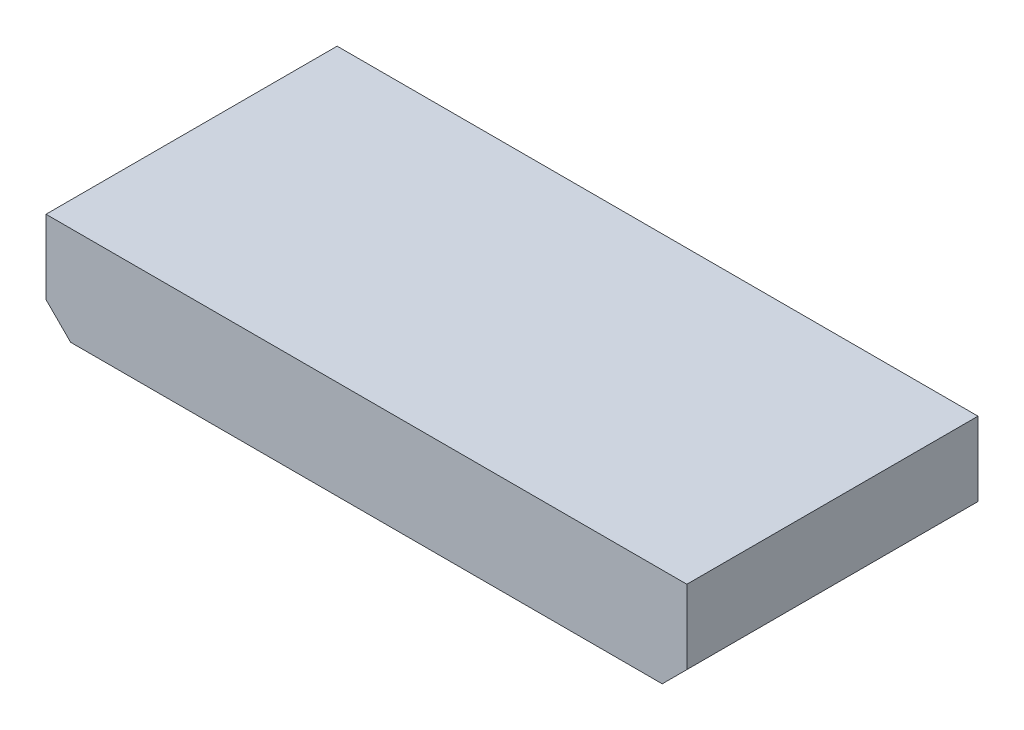
ISO-10303-21;
HEADER;
FILE_DESCRIPTION(('STEP AP214'),'2;1');
FILE_NAME('part.step','',(''),(''),'','','');
FILE_SCHEMA(('AUTOMOTIVE_DESIGN { 1 0 10303 214 1 1 1 1 }'));
ENDSEC;
DATA;
#1=APPLICATION_CONTEXT('core data for automotive mechanical design processes');
#2=APPLICATION_PROTOCOL_DEFINITION('international standard','automotive_design',2000,#1);
#3=PRODUCT_CONTEXT('',#1,'mechanical');
#4=PRODUCT('Part','Part','',(#3));
#5=PRODUCT_RELATED_PRODUCT_CATEGORY('part','',(#4));
#6=PRODUCT_DEFINITION_FORMATION('','',#4);
#7=PRODUCT_DEFINITION_CONTEXT('part definition',#1,'design');
#8=PRODUCT_DEFINITION('design','',#6,#7);
#9=PRODUCT_DEFINITION_SHAPE('','',#8);
#10=(LENGTH_UNIT() NAMED_UNIT(*) SI_UNIT(.MILLI.,.METRE.));
#11=(NAMED_UNIT(*) PLANE_ANGLE_UNIT() SI_UNIT($,.RADIAN.));
#12=(NAMED_UNIT(*) SI_UNIT($,.STERADIAN.) SOLID_ANGLE_UNIT());
#13=UNCERTAINTY_MEASURE_WITH_UNIT(LENGTH_MEASURE(1.E-05),#10,'distance_accuracy_value','');
#14=(GEOMETRIC_REPRESENTATION_CONTEXT(3) GLOBAL_UNCERTAINTY_ASSIGNED_CONTEXT((#13)) GLOBAL_UNIT_ASSIGNED_CONTEXT((#10,
#11,#12)) REPRESENTATION_CONTEXT('',''));
#15=CARTESIAN_POINT('',(0.,0.,0.));
#16=DIRECTION('',(0.,0.,1.));
#17=DIRECTION('',(1.,0.,0.));
#18=AXIS2_PLACEMENT_3D('',#15,#16,#17);
#19=CARTESIAN_POINT('',(22.86,0.,-2.));
#20=DIRECTION('',(0.,0.,1.));
#21=DIRECTION('',(1.,0.,0.));
#22=AXIS2_PLACEMENT_3D('',#19,#20,#21);
#23=CYLINDRICAL_SURFACE('',#22,0.25);
#24=CARTESIAN_POINT('',(22.86,0.,-2.));
#25=DIRECTION('',(0.,0.,1.));
#26=DIRECTION('',(1.,0.,0.));
#27=AXIS2_PLACEMENT_3D('',#24,#25,#26);
#28=CIRCLE('',#27,0.25);
#29=CARTESIAN_POINT('',(23.11,0.,-2.));
#30=VERTEX_POINT('',#29);
#31=EDGE_CURVE('E11',#30,#30,#28,.T.);
#32=ORIENTED_EDGE('',*,*,#31,.T.);
#33=EDGE_LOOP('',(#32));
#34=FACE_BOUND('',#33,.T.);
#35=CARTESIAN_POINT('',(22.86,0.,0.));
#36=DIRECTION('',(0.,0.,1.));
#37=DIRECTION('',(1.,0.,0.));
#38=AXIS2_PLACEMENT_3D('',#35,#36,#37);
#39=CIRCLE('',#38,0.25);
#40=CARTESIAN_POINT('',(23.11,0.,0.));
#41=VERTEX_POINT('',#40);
#42=EDGE_CURVE('E43',#41,#41,#39,.T.);
#43=ORIENTED_EDGE('',*,*,#42,.F.);
#44=EDGE_LOOP('',(#43));
#45=FACE_BOUND('',#44,.T.);
#46=ADVANCED_FACE('F40',(#34,#45),#23,.T.);
#47=CARTESIAN_POINT('',(22.86,0.,-2.));
#48=DIRECTION('',(0.,0.,1.));
#49=DIRECTION('',(1.,0.,0.));
#50=AXIS2_PLACEMENT_3D('',#47,#48,#49);
#51=PLANE('',#50);
#52=ORIENTED_EDGE('',*,*,#31,.F.);
#53=EDGE_LOOP('',(#52));
#54=FACE_BOUND('',#53,.T.);
#55=ADVANCED_FACE('F55',(#54),#51,.F.);
#56=CARTESIAN_POINT('',(22.86,0.,0.));
#57=DIRECTION('',(0.,0.,1.));
#58=DIRECTION('',(1.,0.,0.));
#59=AXIS2_PLACEMENT_3D('',#56,#57,#58);
#60=PLANE('',#59);
#61=ORIENTED_EDGE('',*,*,#42,.T.);
#62=EDGE_LOOP('',(#61));
#63=FACE_BOUND('',#62,.T.);
#64=ADVANCED_FACE('F52',(#63),#60,.T.);
#65=CLOSED_SHELL('',(#46,#55,#64));
#66=MANIFOLD_SOLID_BREP('B2',#65);
#67=CARTESIAN_POINT('',(20.32,0.,-2.));
#68=DIRECTION('',(0.,0.,1.));
#69=DIRECTION('',(1.,0.,0.));
#70=AXIS2_PLACEMENT_3D('',#67,#68,#69);
#71=CYLINDRICAL_SURFACE('',#70,0.25);
#72=CARTESIAN_POINT('',(20.32,0.,-2.));
#73=DIRECTION('',(0.,0.,1.));
#74=DIRECTION('',(1.,0.,0.));
#75=AXIS2_PLACEMENT_3D('',#72,#73,#74);
#76=CIRCLE('',#75,0.25);
#77=CARTESIAN_POINT('',(20.57,0.,-2.));
#78=VERTEX_POINT('',#77);
#79=EDGE_CURVE('E39',#78,#78,#76,.T.);
#80=ORIENTED_EDGE('',*,*,#79,.T.);
#81=EDGE_LOOP('',(#80));
#82=FACE_BOUND('',#81,.T.);
#83=CARTESIAN_POINT('',(20.32,0.,0.));
#84=DIRECTION('',(0.,0.,1.));
#85=DIRECTION('',(1.,0.,0.));
#86=AXIS2_PLACEMENT_3D('',#83,#84,#85);
#87=CIRCLE('',#86,0.25);
#88=CARTESIAN_POINT('',(20.57,0.,0.));
#89=VERTEX_POINT('',#88);
#90=EDGE_CURVE('E92',#89,#89,#87,.T.);
#91=ORIENTED_EDGE('',*,*,#90,.F.);
#92=EDGE_LOOP('',(#91));
#93=FACE_BOUND('',#92,.T.);
#94=ADVANCED_FACE('F89',(#82,#93),#71,.T.);
#95=CARTESIAN_POINT('',(20.32,0.,-2.));
#96=DIRECTION('',(0.,0.,1.));
#97=DIRECTION('',(1.,0.,0.));
#98=AXIS2_PLACEMENT_3D('',#95,#96,#97);
#99=PLANE('',#98);
#100=ORIENTED_EDGE('',*,*,#79,.F.);
#101=EDGE_LOOP('',(#100));
#102=FACE_BOUND('',#101,.T.);
#103=ADVANCED_FACE('F104',(#102),#99,.F.);
#104=CARTESIAN_POINT('',(20.32,0.,0.));
#105=DIRECTION('',(0.,0.,1.));
#106=DIRECTION('',(1.,0.,0.));
#107=AXIS2_PLACEMENT_3D('',#104,#105,#106);
#108=PLANE('',#107);
#109=ORIENTED_EDGE('',*,*,#90,.T.);
#110=EDGE_LOOP('',(#109));
#111=FACE_BOUND('',#110,.T.);
#112=ADVANCED_FACE('F101',(#111),#108,.T.);
#113=CLOSED_SHELL('',(#94,#103,#112));
#114=MANIFOLD_SOLID_BREP('B6',#113);
#115=CARTESIAN_POINT('',(17.78,0.,-2.));
#116=DIRECTION('',(0.,0.,1.));
#117=DIRECTION('',(1.,0.,0.));
#118=AXIS2_PLACEMENT_3D('',#115,#116,#117);
#119=CYLINDRICAL_SURFACE('',#118,0.25);
#120=CARTESIAN_POINT('',(17.78,0.,-2.));
#121=DIRECTION('',(0.,0.,1.));
#122=DIRECTION('',(1.,0.,0.));
#123=AXIS2_PLACEMENT_3D('',#120,#121,#122);
#124=CIRCLE('',#123,0.25);
#125=CARTESIAN_POINT('',(18.03,0.,-2.));
#126=VERTEX_POINT('',#125);
#127=EDGE_CURVE('E88',#126,#126,#124,.T.);
#128=ORIENTED_EDGE('',*,*,#127,.T.);
#129=EDGE_LOOP('',(#128));
#130=FACE_BOUND('',#129,.T.);
#131=CARTESIAN_POINT('',(17.78,0.,0.));
#132=DIRECTION('',(0.,0.,1.));
#133=DIRECTION('',(1.,0.,0.));
#134=AXIS2_PLACEMENT_3D('',#131,#132,#133);
#135=CIRCLE('',#134,0.25);
#136=CARTESIAN_POINT('',(18.03,0.,0.));
#137=VERTEX_POINT('',#136);
#138=EDGE_CURVE('E141',#137,#137,#135,.T.);
#139=ORIENTED_EDGE('',*,*,#138,.F.);
#140=EDGE_LOOP('',(#139));
#141=FACE_BOUND('',#140,.T.);
#142=ADVANCED_FACE('F138',(#130,#141),#119,.T.);
#143=CARTESIAN_POINT('',(17.78,0.,-2.));
#144=DIRECTION('',(0.,0.,1.));
#145=DIRECTION('',(1.,0.,0.));
#146=AXIS2_PLACEMENT_3D('',#143,#144,#145);
#147=PLANE('',#146);
#148=ORIENTED_EDGE('',*,*,#127,.F.);
#149=EDGE_LOOP('',(#148));
#150=FACE_BOUND('',#149,.T.);
#151=ADVANCED_FACE('F153',(#150),#147,.F.);
#152=CARTESIAN_POINT('',(17.78,0.,0.));
#153=DIRECTION('',(0.,0.,1.));
#154=DIRECTION('',(1.,0.,0.));
#155=AXIS2_PLACEMENT_3D('',#152,#153,#154);
#156=PLANE('',#155);
#157=ORIENTED_EDGE('',*,*,#138,.T.);
#158=EDGE_LOOP('',(#157));
#159=FACE_BOUND('',#158,.T.);
#160=ADVANCED_FACE('F150',(#159),#156,.T.);
#161=CLOSED_SHELL('',(#142,#151,#160));
#162=MANIFOLD_SOLID_BREP('B34',#161);
#163=CARTESIAN_POINT('',(15.24,0.,-2.));
#164=DIRECTION('',(0.,0.,1.));
#165=DIRECTION('',(1.,0.,0.));
#166=AXIS2_PLACEMENT_3D('',#163,#164,#165);
#167=CYLINDRICAL_SURFACE('',#166,0.25);
#168=CARTESIAN_POINT('',(15.24,0.,-2.));
#169=DIRECTION('',(0.,0.,1.));
#170=DIRECTION('',(1.,0.,0.));
#171=AXIS2_PLACEMENT_3D('',#168,#169,#170);
#172=CIRCLE('',#171,0.25);
#173=CARTESIAN_POINT('',(15.49,0.,-2.));
#174=VERTEX_POINT('',#173);
#175=EDGE_CURVE('E137',#174,#174,#172,.T.);
#176=ORIENTED_EDGE('',*,*,#175,.T.);
#177=EDGE_LOOP('',(#176));
#178=FACE_BOUND('',#177,.T.);
#179=CARTESIAN_POINT('',(15.24,0.,0.));
#180=DIRECTION('',(0.,0.,1.));
#181=DIRECTION('',(1.,0.,0.));
#182=AXIS2_PLACEMENT_3D('',#179,#180,#181);
#183=CIRCLE('',#182,0.25);
#184=CARTESIAN_POINT('',(15.49,0.,0.));
#185=VERTEX_POINT('',#184);
#186=EDGE_CURVE('E190',#185,#185,#183,.T.);
#187=ORIENTED_EDGE('',*,*,#186,.F.);
#188=EDGE_LOOP('',(#187));
#189=FACE_BOUND('',#188,.T.);
#190=ADVANCED_FACE('F187',(#178,#189),#167,.T.);
#191=CARTESIAN_POINT('',(15.24,0.,-2.));
#192=DIRECTION('',(0.,0.,1.));
#193=DIRECTION('',(1.,0.,0.));
#194=AXIS2_PLACEMENT_3D('',#191,#192,#193);
#195=PLANE('',#194);
#196=ORIENTED_EDGE('',*,*,#175,.F.);
#197=EDGE_LOOP('',(#196));
#198=FACE_BOUND('',#197,.T.);
#199=ADVANCED_FACE('F202',(#198),#195,.F.);
#200=CARTESIAN_POINT('',(15.24,0.,0.));
#201=DIRECTION('',(0.,0.,1.));
#202=DIRECTION('',(1.,0.,0.));
#203=AXIS2_PLACEMENT_3D('',#200,#201,#202);
#204=PLANE('',#203);
#205=ORIENTED_EDGE('',*,*,#186,.T.);
#206=EDGE_LOOP('',(#205));
#207=FACE_BOUND('',#206,.T.);
#208=ADVANCED_FACE('F199',(#207),#204,.T.);
#209=CLOSED_SHELL('',(#190,#199,#208));
#210=MANIFOLD_SOLID_BREP('B83',#209);
#211=CARTESIAN_POINT('',(12.7,0.,-2.));
#212=DIRECTION('',(0.,0.,1.));
#213=DIRECTION('',(1.,0.,0.));
#214=AXIS2_PLACEMENT_3D('',#211,#212,#213);
#215=CYLINDRICAL_SURFACE('',#214,0.25);
#216=CARTESIAN_POINT('',(12.7,0.,-2.));
#217=DIRECTION('',(0.,0.,1.));
#218=DIRECTION('',(1.,0.,0.));
#219=AXIS2_PLACEMENT_3D('',#216,#217,#218);
#220=CIRCLE('',#219,0.25);
#221=CARTESIAN_POINT('',(12.95,0.,-2.));
#222=VERTEX_POINT('',#221);
#223=EDGE_CURVE('E186',#222,#222,#220,.T.);
#224=ORIENTED_EDGE('',*,*,#223,.T.);
#225=EDGE_LOOP('',(#224));
#226=FACE_BOUND('',#225,.T.);
#227=CARTESIAN_POINT('',(12.7,0.,0.));
#228=DIRECTION('',(0.,0.,1.));
#229=DIRECTION('',(1.,0.,0.));
#230=AXIS2_PLACEMENT_3D('',#227,#228,#229);
#231=CIRCLE('',#230,0.25);
#232=CARTESIAN_POINT('',(12.95,0.,0.));
#233=VERTEX_POINT('',#232);
#234=EDGE_CURVE('E239',#233,#233,#231,.T.);
#235=ORIENTED_EDGE('',*,*,#234,.F.);
#236=EDGE_LOOP('',(#235));
#237=FACE_BOUND('',#236,.T.);
#238=ADVANCED_FACE('F236',(#226,#237),#215,.T.);
#239=CARTESIAN_POINT('',(12.7,0.,-2.));
#240=DIRECTION('',(0.,0.,1.));
#241=DIRECTION('',(1.,0.,0.));
#242=AXIS2_PLACEMENT_3D('',#239,#240,#241);
#243=PLANE('',#242);
#244=ORIENTED_EDGE('',*,*,#223,.F.);
#245=EDGE_LOOP('',(#244));
#246=FACE_BOUND('',#245,.T.);
#247=ADVANCED_FACE('F251',(#246),#243,.F.);
#248=CARTESIAN_POINT('',(12.7,0.,0.));
#249=DIRECTION('',(0.,0.,1.));
#250=DIRECTION('',(1.,0.,0.));
#251=AXIS2_PLACEMENT_3D('',#248,#249,#250);
#252=PLANE('',#251);
#253=ORIENTED_EDGE('',*,*,#234,.T.);
#254=EDGE_LOOP('',(#253));
#255=FACE_BOUND('',#254,.T.);
#256=ADVANCED_FACE('F248',(#255),#252,.T.);
#257=CLOSED_SHELL('',(#238,#247,#256));
#258=MANIFOLD_SOLID_BREP('B132',#257);
#259=CARTESIAN_POINT('',(10.16,0.,-2.));
#260=DIRECTION('',(0.,0.,1.));
#261=DIRECTION('',(1.,0.,0.));
#262=AXIS2_PLACEMENT_3D('',#259,#260,#261);
#263=CYLINDRICAL_SURFACE('',#262,0.25);
#264=CARTESIAN_POINT('',(10.16,0.,-2.));
#265=DIRECTION('',(0.,0.,1.));
#266=DIRECTION('',(1.,0.,0.));
#267=AXIS2_PLACEMENT_3D('',#264,#265,#266);
#268=CIRCLE('',#267,0.25);
#269=CARTESIAN_POINT('',(10.41,0.,-2.));
#270=VERTEX_POINT('',#269);
#271=EDGE_CURVE('E235',#270,#270,#268,.T.);
#272=ORIENTED_EDGE('',*,*,#271,.T.);
#273=EDGE_LOOP('',(#272));
#274=FACE_BOUND('',#273,.T.);
#275=CARTESIAN_POINT('',(10.16,0.,0.));
#276=DIRECTION('',(0.,0.,1.));
#277=DIRECTION('',(1.,0.,0.));
#278=AXIS2_PLACEMENT_3D('',#275,#276,#277);
#279=CIRCLE('',#278,0.25);
#280=CARTESIAN_POINT('',(10.41,0.,0.));
#281=VERTEX_POINT('',#280);
#282=EDGE_CURVE('E288',#281,#281,#279,.T.);
#283=ORIENTED_EDGE('',*,*,#282,.F.);
#284=EDGE_LOOP('',(#283));
#285=FACE_BOUND('',#284,.T.);
#286=ADVANCED_FACE('F285',(#274,#285),#263,.T.);
#287=CARTESIAN_POINT('',(10.16,0.,-2.));
#288=DIRECTION('',(0.,0.,1.));
#289=DIRECTION('',(1.,0.,0.));
#290=AXIS2_PLACEMENT_3D('',#287,#288,#289);
#291=PLANE('',#290);
#292=ORIENTED_EDGE('',*,*,#271,.F.);
#293=EDGE_LOOP('',(#292));
#294=FACE_BOUND('',#293,.T.);
#295=ADVANCED_FACE('F300',(#294),#291,.F.);
#296=CARTESIAN_POINT('',(10.16,0.,0.));
#297=DIRECTION('',(0.,0.,1.));
#298=DIRECTION('',(1.,0.,0.));
#299=AXIS2_PLACEMENT_3D('',#296,#297,#298);
#300=PLANE('',#299);
#301=ORIENTED_EDGE('',*,*,#282,.T.);
#302=EDGE_LOOP('',(#301));
#303=FACE_BOUND('',#302,.T.);
#304=ADVANCED_FACE('F297',(#303),#300,.T.);
#305=CLOSED_SHELL('',(#286,#295,#304));
#306=MANIFOLD_SOLID_BREP('B181',#305);
#307=CARTESIAN_POINT('',(7.62,0.,-2.));
#308=DIRECTION('',(0.,0.,1.));
#309=DIRECTION('',(1.,0.,0.));
#310=AXIS2_PLACEMENT_3D('',#307,#308,#309);
#311=CYLINDRICAL_SURFACE('',#310,0.25);
#312=CARTESIAN_POINT('',(7.62,0.,-2.));
#313=DIRECTION('',(0.,0.,1.));
#314=DIRECTION('',(1.,0.,0.));
#315=AXIS2_PLACEMENT_3D('',#312,#313,#314);
#316=CIRCLE('',#315,0.25);
#317=CARTESIAN_POINT('',(7.87,0.,-2.));
#318=VERTEX_POINT('',#317);
#319=EDGE_CURVE('E284',#318,#318,#316,.T.);
#320=ORIENTED_EDGE('',*,*,#319,.T.);
#321=EDGE_LOOP('',(#320));
#322=FACE_BOUND('',#321,.T.);
#323=CARTESIAN_POINT('',(7.62,0.,0.));
#324=DIRECTION('',(0.,0.,1.));
#325=DIRECTION('',(1.,0.,0.));
#326=AXIS2_PLACEMENT_3D('',#323,#324,#325);
#327=CIRCLE('',#326,0.25);
#328=CARTESIAN_POINT('',(7.87,0.,0.));
#329=VERTEX_POINT('',#328);
#330=EDGE_CURVE('E337',#329,#329,#327,.T.);
#331=ORIENTED_EDGE('',*,*,#330,.F.);
#332=EDGE_LOOP('',(#331));
#333=FACE_BOUND('',#332,.T.);
#334=ADVANCED_FACE('F334',(#322,#333),#311,.T.);
#335=CARTESIAN_POINT('',(7.62,0.,-2.));
#336=DIRECTION('',(0.,0.,1.));
#337=DIRECTION('',(1.,0.,0.));
#338=AXIS2_PLACEMENT_3D('',#335,#336,#337);
#339=PLANE('',#338);
#340=ORIENTED_EDGE('',*,*,#319,.F.);
#341=EDGE_LOOP('',(#340));
#342=FACE_BOUND('',#341,.T.);
#343=ADVANCED_FACE('F349',(#342),#339,.F.);
#344=CARTESIAN_POINT('',(7.62,0.,0.));
#345=DIRECTION('',(0.,0.,1.));
#346=DIRECTION('',(1.,0.,0.));
#347=AXIS2_PLACEMENT_3D('',#344,#345,#346);
#348=PLANE('',#347);
#349=ORIENTED_EDGE('',*,*,#330,.T.);
#350=EDGE_LOOP('',(#349));
#351=FACE_BOUND('',#350,.T.);
#352=ADVANCED_FACE('F346',(#351),#348,.T.);
#353=CLOSED_SHELL('',(#334,#343,#352));
#354=MANIFOLD_SOLID_BREP('B230',#353);
#355=CARTESIAN_POINT('',(5.08,0.,-2.));
#356=DIRECTION('',(0.,0.,1.));
#357=DIRECTION('',(1.,0.,0.));
#358=AXIS2_PLACEMENT_3D('',#355,#356,#357);
#359=CYLINDRICAL_SURFACE('',#358,0.25);
#360=CARTESIAN_POINT('',(5.08,0.,-2.));
#361=DIRECTION('',(0.,0.,1.));
#362=DIRECTION('',(1.,0.,0.));
#363=AXIS2_PLACEMENT_3D('',#360,#361,#362);
#364=CIRCLE('',#363,0.25);
#365=CARTESIAN_POINT('',(5.33,0.,-2.));
#366=VERTEX_POINT('',#365);
#367=EDGE_CURVE('E333',#366,#366,#364,.T.);
#368=ORIENTED_EDGE('',*,*,#367,.T.);
#369=EDGE_LOOP('',(#368));
#370=FACE_BOUND('',#369,.T.);
#371=CARTESIAN_POINT('',(5.08,0.,0.));
#372=DIRECTION('',(0.,0.,1.));
#373=DIRECTION('',(1.,0.,0.));
#374=AXIS2_PLACEMENT_3D('',#371,#372,#373);
#375=CIRCLE('',#374,0.25);
#376=CARTESIAN_POINT('',(5.33,0.,0.));
#377=VERTEX_POINT('',#376);
#378=EDGE_CURVE('E386',#377,#377,#375,.T.);
#379=ORIENTED_EDGE('',*,*,#378,.F.);
#380=EDGE_LOOP('',(#379));
#381=FACE_BOUND('',#380,.T.);
#382=ADVANCED_FACE('F383',(#370,#381),#359,.T.);
#383=CARTESIAN_POINT('',(5.08,0.,-2.));
#384=DIRECTION('',(0.,0.,1.));
#385=DIRECTION('',(1.,0.,0.));
#386=AXIS2_PLACEMENT_3D('',#383,#384,#385);
#387=PLANE('',#386);
#388=ORIENTED_EDGE('',*,*,#367,.F.);
#389=EDGE_LOOP('',(#388));
#390=FACE_BOUND('',#389,.T.);
#391=ADVANCED_FACE('F398',(#390),#387,.F.);
#392=CARTESIAN_POINT('',(5.08,0.,0.));
#393=DIRECTION('',(0.,0.,1.));
#394=DIRECTION('',(1.,0.,0.));
#395=AXIS2_PLACEMENT_3D('',#392,#393,#394);
#396=PLANE('',#395);
#397=ORIENTED_EDGE('',*,*,#378,.T.);
#398=EDGE_LOOP('',(#397));
#399=FACE_BOUND('',#398,.T.);
#400=ADVANCED_FACE('F395',(#399),#396,.T.);
#401=CLOSED_SHELL('',(#382,#391,#400));
#402=MANIFOLD_SOLID_BREP('B279',#401);
#403=CARTESIAN_POINT('',(2.54,0.,-2.));
#404=DIRECTION('',(0.,0.,1.));
#405=DIRECTION('',(1.,0.,0.));
#406=AXIS2_PLACEMENT_3D('',#403,#404,#405);
#407=CYLINDRICAL_SURFACE('',#406,0.25);
#408=CARTESIAN_POINT('',(2.54,0.,-2.));
#409=DIRECTION('',(0.,0.,1.));
#410=DIRECTION('',(1.,0.,0.));
#411=AXIS2_PLACEMENT_3D('',#408,#409,#410);
#412=CIRCLE('',#411,0.25);
#413=CARTESIAN_POINT('',(2.79,0.,-2.));
#414=VERTEX_POINT('',#413);
#415=EDGE_CURVE('E382',#414,#414,#412,.T.);
#416=ORIENTED_EDGE('',*,*,#415,.T.);
#417=EDGE_LOOP('',(#416));
#418=FACE_BOUND('',#417,.T.);
#419=CARTESIAN_POINT('',(2.54,0.,0.));
#420=DIRECTION('',(0.,0.,1.));
#421=DIRECTION('',(1.,0.,0.));
#422=AXIS2_PLACEMENT_3D('',#419,#420,#421);
#423=CIRCLE('',#422,0.25);
#424=CARTESIAN_POINT('',(2.79,0.,0.));
#425=VERTEX_POINT('',#424);
#426=EDGE_CURVE('E435',#425,#425,#423,.T.);
#427=ORIENTED_EDGE('',*,*,#426,.F.);
#428=EDGE_LOOP('',(#427));
#429=FACE_BOUND('',#428,.T.);
#430=ADVANCED_FACE('F432',(#418,#429),#407,.T.);
#431=CARTESIAN_POINT('',(2.54,0.,-2.));
#432=DIRECTION('',(0.,0.,1.));
#433=DIRECTION('',(1.,0.,0.));
#434=AXIS2_PLACEMENT_3D('',#431,#432,#433);
#435=PLANE('',#434);
#436=ORIENTED_EDGE('',*,*,#415,.F.);
#437=EDGE_LOOP('',(#436));
#438=FACE_BOUND('',#437,.T.);
#439=ADVANCED_FACE('F447',(#438),#435,.F.);
#440=CARTESIAN_POINT('',(2.54,0.,0.));
#441=DIRECTION('',(0.,0.,1.));
#442=DIRECTION('',(1.,0.,0.));
#443=AXIS2_PLACEMENT_3D('',#440,#441,#442);
#444=PLANE('',#443);
#445=ORIENTED_EDGE('',*,*,#426,.T.);
#446=EDGE_LOOP('',(#445));
#447=FACE_BOUND('',#446,.T.);
#448=ADVANCED_FACE('F444',(#447),#444,.T.);
#449=CLOSED_SHELL('',(#430,#439,#448));
#450=MANIFOLD_SOLID_BREP('B328',#449);
#451=CARTESIAN_POINT('',(0.,0.,-2.));
#452=DIRECTION('',(0.,0.,1.));
#453=DIRECTION('',(1.,0.,0.));
#454=AXIS2_PLACEMENT_3D('',#451,#452,#453);
#455=CYLINDRICAL_SURFACE('',#454,0.25);
#456=CARTESIAN_POINT('',(0.,0.,-2.));
#457=DIRECTION('',(0.,0.,1.));
#458=DIRECTION('',(1.,0.,0.));
#459=AXIS2_PLACEMENT_3D('',#456,#457,#458);
#460=CIRCLE('',#459,0.25);
#461=CARTESIAN_POINT('',(0.25,0.,-2.));
#462=VERTEX_POINT('',#461);
#463=EDGE_CURVE('E431',#462,#462,#460,.T.);
#464=ORIENTED_EDGE('',*,*,#463,.T.);
#465=EDGE_LOOP('',(#464));
#466=FACE_BOUND('',#465,.T.);
#467=CARTESIAN_POINT('',(0.,0.,0.));
#468=DIRECTION('',(0.,0.,1.));
#469=DIRECTION('',(1.,0.,0.));
#470=AXIS2_PLACEMENT_3D('',#467,#468,#469);
#471=CIRCLE('',#470,0.25);
#472=CARTESIAN_POINT('',(0.25,0.,0.));
#473=VERTEX_POINT('',#472);
#474=EDGE_CURVE('E485',#473,#473,#471,.T.);
#475=ORIENTED_EDGE('',*,*,#474,.F.);
#476=EDGE_LOOP('',(#475));
#477=FACE_BOUND('',#476,.T.);
#478=ADVANCED_FACE('F482',(#466,#477),#455,.T.);
#479=CARTESIAN_POINT('',(0.,0.,-2.));
#480=DIRECTION('',(0.,0.,1.));
#481=DIRECTION('',(1.,0.,0.));
#482=AXIS2_PLACEMENT_3D('',#479,#480,#481);
#483=PLANE('',#482);
#484=ORIENTED_EDGE('',*,*,#463,.F.);
#485=EDGE_LOOP('',(#484));
#486=FACE_BOUND('',#485,.T.);
#487=ADVANCED_FACE('F497',(#486),#483,.F.);
#488=CARTESIAN_POINT('',(0.,0.,0.));
#489=DIRECTION('',(0.,0.,1.));
#490=DIRECTION('',(1.,0.,0.));
#491=AXIS2_PLACEMENT_3D('',#488,#489,#490);
#492=PLANE('',#491);
#493=ORIENTED_EDGE('',*,*,#474,.T.);
#494=EDGE_LOOP('',(#493));
#495=FACE_BOUND('',#494,.T.);
#496=ADVANCED_FACE('F494',(#495),#492,.T.);
#497=CLOSED_SHELL('',(#478,#487,#496));
#498=MANIFOLD_SOLID_BREP('B377',#497);
#499=CARTESIAN_POINT('',(27.94,2.54,15.));
#500=DIRECTION('',(0.,-1.,0.));
#501=DIRECTION('',(0.,0.,-1.));
#502=AXIS2_PLACEMENT_3D('',#499,#500,#501);
#503=PLANE('',#502);
#504=DIRECTION('',(-1.,0.,0.));
#505=VECTOR('',#504,1.);
#506=CARTESIAN_POINT('',(27.94,2.54,0.));
#507=LINE('',#506,#505);
#508=CARTESIAN_POINT('',(27.94,2.54,0.));
#509=VERTEX_POINT('',#508);
#510=CARTESIAN_POINT('',(-5.08,2.54,0.));
#511=VERTEX_POINT('',#510);
#512=EDGE_CURVE('E607',#509,#511,#507,.T.);
#513=ORIENTED_EDGE('',*,*,#512,.T.);
#514=DIRECTION('',(0.,0.,-1.));
#515=VECTOR('',#514,1.);
#516=CARTESIAN_POINT('',(-5.08,2.54,15.));
#517=LINE('',#516,#515);
#518=CARTESIAN_POINT('',(-5.08,2.54,15.));
#519=VERTEX_POINT('',#518);
#520=EDGE_CURVE('E480',#519,#511,#517,.T.);
#521=ORIENTED_EDGE('',*,*,#520,.F.);
#522=DIRECTION('',(-1.,0.,0.));
#523=VECTOR('',#522,1.);
#524=CARTESIAN_POINT('',(27.94,2.54,15.));
#525=LINE('',#524,#523);
#526=CARTESIAN_POINT('',(27.94,2.54,15.));
#527=VERTEX_POINT('',#526);
#528=EDGE_CURVE('E617',#527,#519,#525,.T.);
#529=ORIENTED_EDGE('',*,*,#528,.F.);
#530=DIRECTION('',(0.,0.,-1.));
#531=VECTOR('',#530,1.);
#532=CARTESIAN_POINT('',(27.94,2.54,15.));
#533=LINE('',#532,#531);
#534=EDGE_CURVE('E603',#527,#509,#533,.T.);
#535=ORIENTED_EDGE('',*,*,#534,.T.);
#536=EDGE_LOOP('',(#513,#521,#529,#535));
#537=FACE_BOUND('',#536,.T.);
#538=ADVANCED_FACE('F523',(#537),#503,.F.);
#539=CARTESIAN_POINT('',(-5.08,2.54,15.));
#540=DIRECTION('',(1.,0.,0.));
#541=DIRECTION('',(0.,0.,-1.));
#542=AXIS2_PLACEMENT_3D('',#539,#540,#541);
#543=PLANE('',#542);
#544=DIRECTION('',(0.,-1.,0.));
#545=VECTOR('',#544,1.);
#546=CARTESIAN_POINT('',(-5.08,2.54,0.));
#547=LINE('',#546,#545);
#548=CARTESIAN_POINT('',(-5.08,-1.27,0.));
#549=VERTEX_POINT('',#548);
#550=EDGE_CURVE('E610',#511,#549,#547,.T.);
#551=ORIENTED_EDGE('',*,*,#550,.T.);
#552=DIRECTION('',(0.,0.,-1.));
#553=VECTOR('',#552,1.);
#554=CARTESIAN_POINT('',(-5.08,-1.27,15.));
#555=LINE('',#554,#553);
#556=CARTESIAN_POINT('',(-5.08,-1.27,15.));
#557=VERTEX_POINT('',#556);
#558=EDGE_CURVE('E531',#557,#549,#555,.T.);
#559=ORIENTED_EDGE('',*,*,#558,.F.);
#560=DIRECTION('',(0.,-1.,0.));
#561=VECTOR('',#560,1.);
#562=CARTESIAN_POINT('',(-5.08,2.54,15.));
#563=LINE('',#562,#561);
#564=EDGE_CURVE('E576',#519,#557,#563,.T.);
#565=ORIENTED_EDGE('',*,*,#564,.F.);
#566=ORIENTED_EDGE('',*,*,#520,.T.);
#567=EDGE_LOOP('',(#551,#559,#565,#566));
#568=FACE_BOUND('',#567,.T.);
#569=ADVANCED_FACE('F641',(#568),#543,.F.);
#570=CARTESIAN_POINT('',(-5.08,-1.27,15.));
#571=DIRECTION('',(0.707106781186547,0.707106781186548,0.));
#572=DIRECTION('',(-0.707106781186548,0.707106781186547,0.));
#573=AXIS2_PLACEMENT_3D('',#570,#571,#572);
#574=PLANE('',#573);
#575=DIRECTION('',(0.707106781186548,-0.707106781186547,0.));
#576=VECTOR('',#575,1.);
#577=CARTESIAN_POINT('',(-5.08,-1.27,0.));
#578=LINE('',#577,#576);
#579=CARTESIAN_POINT('',(-3.81,-2.54,0.));
#580=VERTEX_POINT('',#579);
#581=EDGE_CURVE('E612',#549,#580,#578,.T.);
#582=ORIENTED_EDGE('',*,*,#581,.T.);
#583=DIRECTION('',(0.,0.,-1.));
#584=VECTOR('',#583,1.);
#585=CARTESIAN_POINT('',(-3.81,-2.54,15.));
#586=LINE('',#585,#584);
#587=CARTESIAN_POINT('',(-3.81,-2.54,15.));
#588=VERTEX_POINT('',#587);
#589=EDGE_CURVE('E598',#588,#580,#586,.T.);
#590=ORIENTED_EDGE('',*,*,#589,.F.);
#591=DIRECTION('',(0.707106781186548,-0.707106781186547,0.));
#592=VECTOR('',#591,1.);
#593=CARTESIAN_POINT('',(-5.08,-1.27,15.));
#594=LINE('',#593,#592);
#595=EDGE_CURVE('E589',#557,#588,#594,.T.);
#596=ORIENTED_EDGE('',*,*,#595,.F.);
#597=ORIENTED_EDGE('',*,*,#558,.T.);
#598=EDGE_LOOP('',(#582,#590,#596,#597));
#599=FACE_BOUND('',#598,.T.);
#600=ADVANCED_FACE('F623',(#599),#574,.F.);
#601=CARTESIAN_POINT('',(-3.81,-2.54,15.));
#602=DIRECTION('',(0.,1.,0.));
#603=DIRECTION('',(0.,0.,1.));
#604=AXIS2_PLACEMENT_3D('',#601,#602,#603);
#605=PLANE('',#604);
#606=DIRECTION('',(1.,0.,0.));
#607=VECTOR('',#606,1.);
#608=CARTESIAN_POINT('',(-3.81,-2.54,0.));
#609=LINE('',#608,#607);
#610=CARTESIAN_POINT('',(26.67,-2.54,0.));
#611=VERTEX_POINT('',#610);
#612=EDGE_CURVE('E597',#580,#611,#609,.T.);
#613=ORIENTED_EDGE('',*,*,#612,.T.);
#614=DIRECTION('',(0.,0.,-1.));
#615=VECTOR('',#614,1.);
#616=CARTESIAN_POINT('',(26.67,-2.54,15.));
#617=LINE('',#616,#615);
#618=CARTESIAN_POINT('',(26.67,-2.54,15.));
#619=VERTEX_POINT('',#618);
#620=EDGE_CURVE('E594',#619,#611,#617,.T.);
#621=ORIENTED_EDGE('',*,*,#620,.F.);
#622=DIRECTION('',(1.,0.,0.));
#623=VECTOR('',#622,1.);
#624=CARTESIAN_POINT('',(-3.81,-2.54,15.));
#625=LINE('',#624,#623);
#626=EDGE_CURVE('E583',#588,#619,#625,.T.);
#627=ORIENTED_EDGE('',*,*,#626,.F.);
#628=ORIENTED_EDGE('',*,*,#589,.T.);
#629=EDGE_LOOP('',(#613,#621,#627,#628));
#630=FACE_BOUND('',#629,.T.);
#631=ADVANCED_FACE('F595',(#630),#605,.F.);
#632=CARTESIAN_POINT('',(26.67,-2.54,15.));
#633=DIRECTION('',(-0.707106781186549,0.707106781186547,0.));
#634=DIRECTION('',(-0.707106781186547,-0.707106781186549,0.));
#635=AXIS2_PLACEMENT_3D('',#632,#633,#634);
#636=PLANE('',#635);
#637=DIRECTION('',(0.707106781186547,0.707106781186548,0.));
#638=VECTOR('',#637,1.);
#639=CARTESIAN_POINT('',(26.67,-2.54,0.));
#640=LINE('',#639,#638);
#641=CARTESIAN_POINT('',(27.94,-1.27,0.));
#642=VERTEX_POINT('',#641);
#643=EDGE_CURVE('E562',#611,#642,#640,.T.);
#644=ORIENTED_EDGE('',*,*,#643,.T.);
#645=DIRECTION('',(0.,0.,-1.));
#646=VECTOR('',#645,1.);
#647=CARTESIAN_POINT('',(27.94,-1.27,15.));
#648=LINE('',#647,#646);
#649=CARTESIAN_POINT('',(27.94,-1.27,15.));
#650=VERTEX_POINT('',#649);
#651=EDGE_CURVE('E599',#650,#642,#648,.T.);
#652=ORIENTED_EDGE('',*,*,#651,.F.);
#653=DIRECTION('',(0.707106781186547,0.707106781186548,0.));
#654=VECTOR('',#653,1.);
#655=CARTESIAN_POINT('',(26.67,-2.54,15.));
#656=LINE('',#655,#654);
#657=EDGE_CURVE('E587',#619,#650,#656,.T.);
#658=ORIENTED_EDGE('',*,*,#657,.F.);
#659=ORIENTED_EDGE('',*,*,#620,.T.);
#660=EDGE_LOOP('',(#644,#652,#658,#659));
#661=FACE_BOUND('',#660,.T.);
#662=ADVANCED_FACE('F601',(#661),#636,.F.);
#663=CARTESIAN_POINT('',(27.94,-1.27,15.));
#664=DIRECTION('',(-1.,0.,0.));
#665=DIRECTION('',(0.,0.,1.));
#666=AXIS2_PLACEMENT_3D('',#663,#664,#665);
#667=PLANE('',#666);
#668=DIRECTION('',(0.,1.,0.));
#669=VECTOR('',#668,1.);
#670=CARTESIAN_POINT('',(27.94,-1.27,0.));
#671=LINE('',#670,#669);
#672=EDGE_CURVE('E568',#642,#509,#671,.T.);
#673=ORIENTED_EDGE('',*,*,#672,.T.);
#674=ORIENTED_EDGE('',*,*,#534,.F.);
#675=DIRECTION('',(0.,1.,0.));
#676=VECTOR('',#675,1.);
#677=CARTESIAN_POINT('',(27.94,-1.27,15.));
#678=LINE('',#677,#676);
#679=EDGE_CURVE('E539',#650,#527,#678,.T.);
#680=ORIENTED_EDGE('',*,*,#679,.F.);
#681=ORIENTED_EDGE('',*,*,#651,.T.);
#682=EDGE_LOOP('',(#673,#674,#680,#681));
#683=FACE_BOUND('',#682,.T.);
#684=ADVANCED_FACE('F630',(#683),#667,.F.);
#685=CARTESIAN_POINT('',(0.,0.,15.));
#686=DIRECTION('',(0.,0.,1.));
#687=DIRECTION('',(1.,0.,0.));
#688=AXIS2_PLACEMENT_3D('',#685,#686,#687);
#689=PLANE('',#688);
#690=ORIENTED_EDGE('',*,*,#528,.T.);
#691=ORIENTED_EDGE('',*,*,#564,.T.);
#692=ORIENTED_EDGE('',*,*,#595,.T.);
#693=ORIENTED_EDGE('',*,*,#626,.T.);
#694=ORIENTED_EDGE('',*,*,#657,.T.);
#695=ORIENTED_EDGE('',*,*,#679,.T.);
#696=EDGE_LOOP('',(#690,#691,#692,#693,#694,#695));
#697=FACE_BOUND('',#696,.T.);
#698=ADVANCED_FACE('F585',(#697),#689,.T.);
#699=CARTESIAN_POINT('',(0.,0.,0.));
#700=DIRECTION('',(0.,0.,1.));
#701=DIRECTION('',(1.,0.,0.));
#702=AXIS2_PLACEMENT_3D('',#699,#700,#701);
#703=PLANE('',#702);
#704=ORIENTED_EDGE('',*,*,#512,.F.);
#705=ORIENTED_EDGE('',*,*,#672,.F.);
#706=ORIENTED_EDGE('',*,*,#643,.F.);
#707=ORIENTED_EDGE('',*,*,#612,.F.);
#708=ORIENTED_EDGE('',*,*,#581,.F.);
#709=ORIENTED_EDGE('',*,*,#550,.F.);
#710=EDGE_LOOP('',(#704,#705,#706,#707,#708,#709));
#711=FACE_BOUND('',#710,.T.);
#712=ADVANCED_FACE('F626',(#711),#703,.F.);
#713=CLOSED_SHELL('',(#538,#569,#600,#631,#662,#684,#698,#712));
#714=MANIFOLD_SOLID_BREP('B426',#713);
#715=ADVANCED_BREP_SHAPE_REPRESENTATION('',(#18,#66,#114,#162,#210,#258,#306,#354,#402,#450,
#498,#714),#14);
#716=SHAPE_DEFINITION_REPRESENTATION(#9,#715);
ENDSEC;
END-ISO-10303-21;
